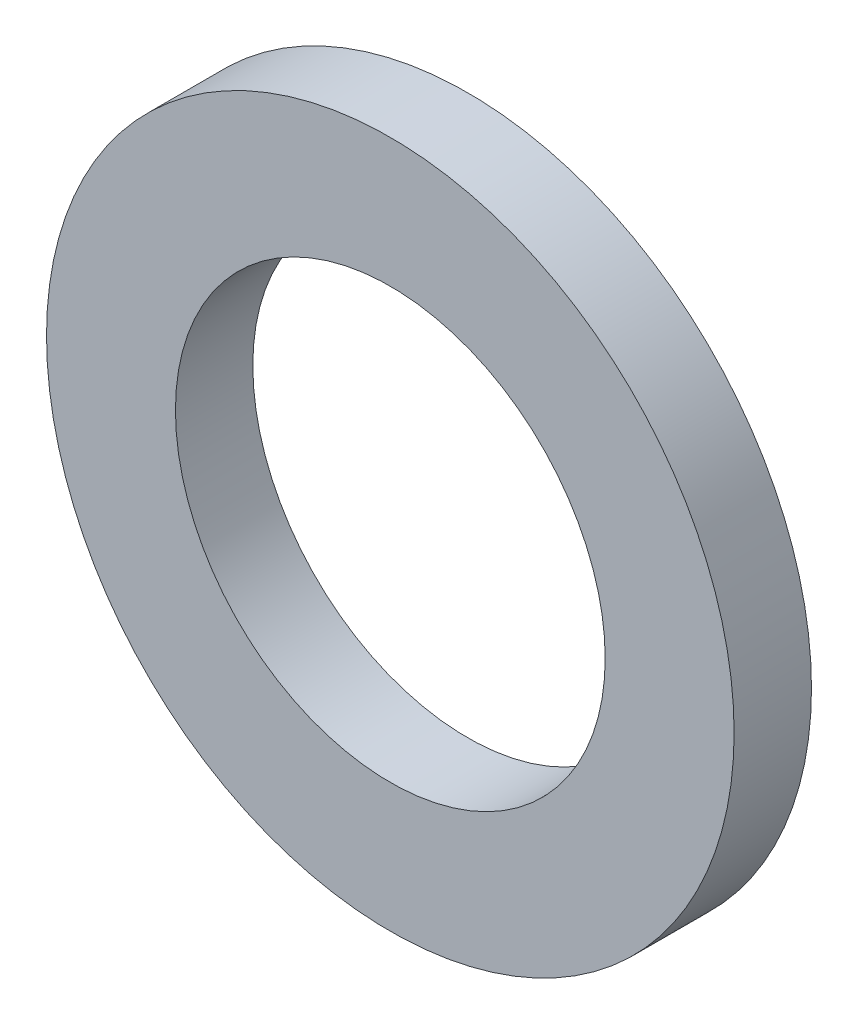
ISO-10303-21;
HEADER;
FILE_DESCRIPTION(('STEP AP214'),'2;1');
FILE_NAME('part.step','',(''),(''),'','','');
FILE_SCHEMA(('AUTOMOTIVE_DESIGN { 1 0 10303 214 1 1 1 1 }'));
ENDSEC;
DATA;
#1=APPLICATION_CONTEXT('core data for automotive mechanical design processes');
#2=APPLICATION_PROTOCOL_DEFINITION('international standard','automotive_design',2000,#1);
#3=PRODUCT_CONTEXT('',#1,'mechanical');
#4=PRODUCT('Part','Part','',(#3));
#5=PRODUCT_RELATED_PRODUCT_CATEGORY('part','',(#4));
#6=PRODUCT_DEFINITION_FORMATION('','',#4);
#7=PRODUCT_DEFINITION_CONTEXT('part definition',#1,'design');
#8=PRODUCT_DEFINITION('design','',#6,#7);
#9=PRODUCT_DEFINITION_SHAPE('','',#8);
#10=(LENGTH_UNIT() NAMED_UNIT(*) SI_UNIT(.MILLI.,.METRE.));
#11=(NAMED_UNIT(*) PLANE_ANGLE_UNIT() SI_UNIT($,.RADIAN.));
#12=(NAMED_UNIT(*) SI_UNIT($,.STERADIAN.) SOLID_ANGLE_UNIT());
#13=UNCERTAINTY_MEASURE_WITH_UNIT(LENGTH_MEASURE(1.E-05),#10,'distance_accuracy_value','');
#14=(GEOMETRIC_REPRESENTATION_CONTEXT(3) GLOBAL_UNCERTAINTY_ASSIGNED_CONTEXT((#13)) GLOBAL_UNIT_ASSIGNED_CONTEXT((#10,
#11,#12)) REPRESENTATION_CONTEXT('',''));
#15=CARTESIAN_POINT('',(0.,0.,0.));
#16=DIRECTION('',(0.,0.,1.));
#17=DIRECTION('',(1.,0.,0.));
#18=AXIS2_PLACEMENT_3D('',#15,#16,#17);
#19=CARTESIAN_POINT('',(0.,0.,1.35));
#20=DIRECTION('',(0.,0.,1.));
#21=DIRECTION('',(1.,0.,0.));
#22=AXIS2_PLACEMENT_3D('',#19,#20,#21);
#23=PLANE('',#22);
#24=CARTESIAN_POINT('',(0.,0.,1.35));
#25=DIRECTION('',(0.,0.,1.));
#26=DIRECTION('',(1.,0.,0.));
#27=AXIS2_PLACEMENT_3D('',#24,#25,#26);
#28=CIRCLE('',#27,12.);
#29=CARTESIAN_POINT('',(12.,0.,1.35));
#30=VERTEX_POINT('',#29);
#31=EDGE_CURVE('E10',#30,#30,#28,.T.);
#32=ORIENTED_EDGE('',*,*,#31,.T.);
#33=EDGE_LOOP('',(#32));
#34=FACE_BOUND('',#33,.T.);
#35=CARTESIAN_POINT('',(0.,0.,1.35));
#36=DIRECTION('',(0.,0.,1.));
#37=DIRECTION('',(1.,0.,0.));
#38=AXIS2_PLACEMENT_3D('',#35,#36,#37);
#39=CIRCLE('',#38,7.5);
#40=CARTESIAN_POINT('',(7.5,0.,1.35));
#41=VERTEX_POINT('',#40);
#42=EDGE_CURVE('E39',#41,#41,#39,.T.);
#43=ORIENTED_EDGE('',*,*,#42,.F.);
#44=EDGE_LOOP('',(#43));
#45=FACE_BOUND('',#44,.T.);
#46=ADVANCED_FACE('F32',(#34,#45),#23,.T.);
#47=CARTESIAN_POINT('',(0.,0.,1.35));
#48=DIRECTION('',(0.,0.,-1.));
#49=DIRECTION('',(-1.,0.,0.));
#50=AXIS2_PLACEMENT_3D('',#47,#48,#49);
#51=CYLINDRICAL_SURFACE('',#50,12.);
#52=ORIENTED_EDGE('',*,*,#31,.F.);
#53=EDGE_LOOP('',(#52));
#54=FACE_BOUND('',#53,.T.);
#55=CARTESIAN_POINT('',(0.,0.,-1.35));
#56=DIRECTION('',(0.,0.,1.));
#57=DIRECTION('',(1.,0.,0.));
#58=AXIS2_PLACEMENT_3D('',#55,#56,#57);
#59=CIRCLE('',#58,12.);
#60=CARTESIAN_POINT('',(12.,0.,-1.35));
#61=VERTEX_POINT('',#60);
#62=EDGE_CURVE('E43',#61,#61,#59,.T.);
#63=ORIENTED_EDGE('',*,*,#62,.T.);
#64=EDGE_LOOP('',(#63));
#65=FACE_BOUND('',#64,.T.);
#66=ADVANCED_FACE('F34',(#54,#65),#51,.T.);
#67=CARTESIAN_POINT('',(0.,0.,1.35));
#68=DIRECTION('',(0.,0.,-1.));
#69=DIRECTION('',(-1.,0.,0.));
#70=AXIS2_PLACEMENT_3D('',#67,#68,#69);
#71=CYLINDRICAL_SURFACE('',#70,7.5);
#72=ORIENTED_EDGE('',*,*,#42,.T.);
#73=EDGE_LOOP('',(#72));
#74=FACE_BOUND('',#73,.T.);
#75=CARTESIAN_POINT('',(0.,0.,-1.35));
#76=DIRECTION('',(0.,0.,1.));
#77=DIRECTION('',(1.,0.,0.));
#78=AXIS2_PLACEMENT_3D('',#75,#76,#77);
#79=CIRCLE('',#78,7.5);
#80=CARTESIAN_POINT('',(7.5,0.,-1.35));
#81=VERTEX_POINT('',#80);
#82=EDGE_CURVE('E47',#81,#81,#79,.T.);
#83=ORIENTED_EDGE('',*,*,#82,.F.);
#84=EDGE_LOOP('',(#83));
#85=FACE_BOUND('',#84,.T.);
#86=ADVANCED_FACE('F56',(#74,#85),#71,.F.);
#87=CARTESIAN_POINT('',(0.,0.,-1.35));
#88=DIRECTION('',(0.,0.,1.));
#89=DIRECTION('',(1.,0.,0.));
#90=AXIS2_PLACEMENT_3D('',#87,#88,#89);
#91=PLANE('',#90);
#92=ORIENTED_EDGE('',*,*,#82,.T.);
#93=EDGE_LOOP('',(#92));
#94=FACE_BOUND('',#93,.T.);
#95=ORIENTED_EDGE('',*,*,#62,.F.);
#96=EDGE_LOOP('',(#95));
#97=FACE_BOUND('',#96,.T.);
#98=ADVANCED_FACE('F53',(#94,#97),#91,.F.);
#99=CLOSED_SHELL('',(#46,#66,#86,#98));
#100=MANIFOLD_SOLID_BREP('B2',#99);
#101=ADVANCED_BREP_SHAPE_REPRESENTATION('',(#18,#100),#14);
#102=SHAPE_DEFINITION_REPRESENTATION(#9,#101);
ENDSEC;
END-ISO-10303-21;
